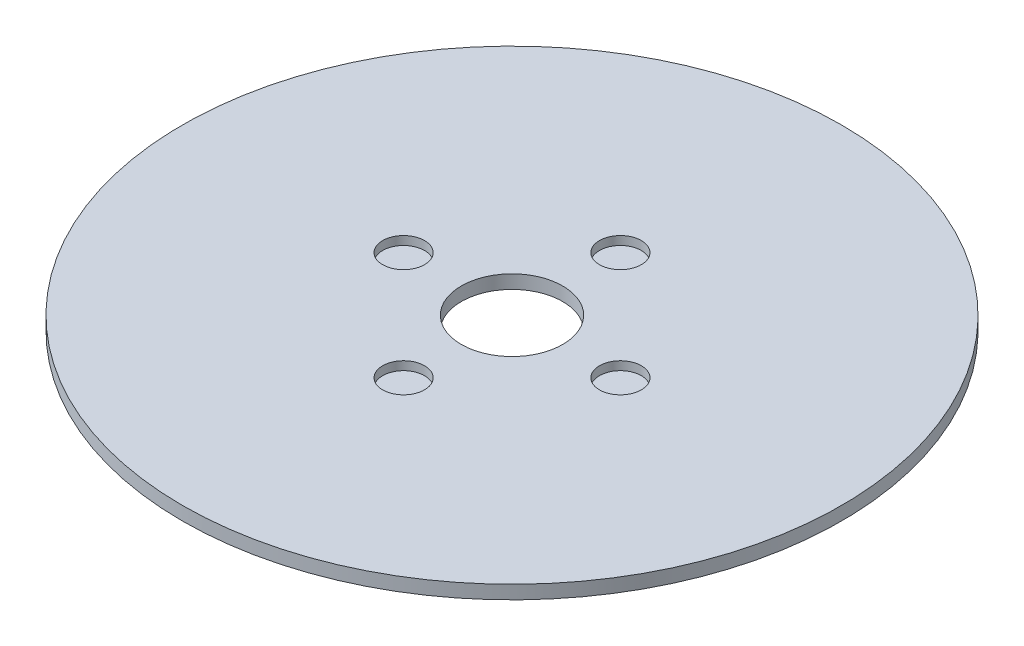
ISO-10303-21;
HEADER;
FILE_DESCRIPTION(('STEP AP214'),'2;1');
FILE_NAME('part.step','',(''),(''),'','','');
FILE_SCHEMA(('AUTOMOTIVE_DESIGN { 1 0 10303 214 1 1 1 1 }'));
ENDSEC;
DATA;
#1=APPLICATION_CONTEXT('core data for automotive mechanical design processes');
#2=APPLICATION_PROTOCOL_DEFINITION('international standard','automotive_design',2000,#1);
#3=PRODUCT_CONTEXT('',#1,'mechanical');
#4=PRODUCT('Part','Part','',(#3));
#5=PRODUCT_RELATED_PRODUCT_CATEGORY('part','',(#4));
#6=PRODUCT_DEFINITION_FORMATION('','',#4);
#7=PRODUCT_DEFINITION_CONTEXT('part definition',#1,'design');
#8=PRODUCT_DEFINITION('design','',#6,#7);
#9=PRODUCT_DEFINITION_SHAPE('','',#8);
#10=(LENGTH_UNIT() NAMED_UNIT(*) SI_UNIT(.MILLI.,.METRE.));
#11=(NAMED_UNIT(*) PLANE_ANGLE_UNIT() SI_UNIT($,.RADIAN.));
#12=(NAMED_UNIT(*) SI_UNIT($,.STERADIAN.) SOLID_ANGLE_UNIT());
#13=UNCERTAINTY_MEASURE_WITH_UNIT(LENGTH_MEASURE(1.E-05),#10,'distance_accuracy_value','');
#14=(GEOMETRIC_REPRESENTATION_CONTEXT(3) GLOBAL_UNCERTAINTY_ASSIGNED_CONTEXT((#13)) GLOBAL_UNIT_ASSIGNED_CONTEXT((#10,
#11,#12)) REPRESENTATION_CONTEXT('',''));
#15=CARTESIAN_POINT('',(0.,0.,0.));
#16=DIRECTION('',(0.,0.,1.));
#17=DIRECTION('',(1.,0.,0.));
#18=AXIS2_PLACEMENT_3D('',#15,#16,#17);
#19=CARTESIAN_POINT('',(0.,4.,0.));
#20=DIRECTION('',(0.,-1.,0.));
#21=DIRECTION('',(0.,0.,-1.));
#22=AXIS2_PLACEMENT_3D('',#19,#20,#21);
#23=CYLINDRICAL_SURFACE('',#22,97.5);
#24=CARTESIAN_POINT('',(0.,4.,0.));
#25=DIRECTION('',(0.,1.,0.));
#26=DIRECTION('',(0.,0.,1.));
#27=AXIS2_PLACEMENT_3D('',#24,#25,#26);
#28=CIRCLE('',#27,97.5);
#29=CARTESIAN_POINT('',(0.,4.,97.5));
#30=VERTEX_POINT('',#29);
#31=EDGE_CURVE('E10',#30,#30,#28,.T.);
#32=ORIENTED_EDGE('',*,*,#31,.F.);
#33=EDGE_LOOP('',(#32));
#34=FACE_BOUND('',#33,.T.);
#35=CARTESIAN_POINT('',(0.,0.,0.));
#36=DIRECTION('',(0.,1.,0.));
#37=DIRECTION('',(0.,0.,1.));
#38=AXIS2_PLACEMENT_3D('',#35,#36,#37);
#39=CIRCLE('',#38,97.5);
#40=CARTESIAN_POINT('',(0.,0.,97.5));
#41=VERTEX_POINT('',#40);
#42=EDGE_CURVE('E37',#41,#41,#39,.T.);
#43=ORIENTED_EDGE('',*,*,#42,.T.);
#44=EDGE_LOOP('',(#43));
#45=FACE_BOUND('',#44,.T.);
#46=ADVANCED_FACE('F40',(#34,#45),#23,.T.);
#47=CARTESIAN_POINT('',(0.,4.,0.));
#48=DIRECTION('',(0.,1.,0.));
#49=DIRECTION('',(0.,0.,1.));
#50=AXIS2_PLACEMENT_3D('',#47,#48,#49);
#51=PLANE('',#50);
#52=CARTESIAN_POINT('',(1.11978454207398E-13,4.,32.0719039685606));
#53=DIRECTION('',(0.,1.,0.));
#54=DIRECTION('',(1.,0.,0.));
#55=AXIS2_PLACEMENT_3D('',#52,#53,#54);
#56=CIRCLE('',#55,6.19048479109425);
#57=CARTESIAN_POINT('',(1.11978454207398E-13,4.,38.2623887596549));
#58=VERTEX_POINT('',#57);
#59=EDGE_CURVE('E71',#58,#58,#56,.T.);
#60=ORIENTED_EDGE('',*,*,#59,.F.);
#61=EDGE_LOOP('',(#60));
#62=FACE_BOUND('',#61,.T.);
#63=CARTESIAN_POINT('',(32.0719039685606,4.,0.));
#64=DIRECTION('',(0.,1.,0.));
#65=DIRECTION('',(0.,0.,-1.));
#66=AXIS2_PLACEMENT_3D('',#63,#64,#65);
#67=CIRCLE('',#66,6.19048479109425);
#68=CARTESIAN_POINT('',(32.0719039685606,4.,6.19048479109425));
#69=VERTEX_POINT('',#68);
#70=EDGE_CURVE('E70',#69,#69,#67,.T.);
#71=ORIENTED_EDGE('',*,*,#70,.F.);
#72=EDGE_LOOP('',(#71));
#73=FACE_BOUND('',#72,.T.);
#74=CARTESIAN_POINT('',(-3.35935362622195E-13,4.,-32.0719039685606));
#75=DIRECTION('',(0.,1.,0.));
#76=DIRECTION('',(-1.,0.,0.));
#77=AXIS2_PLACEMENT_3D('',#74,#75,#76);
#78=CIRCLE('',#77,6.19048479109425);
#79=CARTESIAN_POINT('',(-3.35935362622195E-13,4.,-25.8814191774664));
#80=VERTEX_POINT('',#79);
#81=EDGE_CURVE('E61',#80,#80,#78,.T.);
#82=ORIENTED_EDGE('',*,*,#81,.F.);
#83=EDGE_LOOP('',(#82));
#84=FACE_BOUND('',#83,.T.);
#85=CARTESIAN_POINT('',(-32.0719039685606,4.,0.));
#86=DIRECTION('',(0.,1.,0.));
#87=DIRECTION('',(0.,0.,1.));
#88=AXIS2_PLACEMENT_3D('',#85,#86,#87);
#89=CIRCLE('',#88,6.19048479109425);
#90=CARTESIAN_POINT('',(-32.0719039685606,4.,6.19048479109425));
#91=VERTEX_POINT('',#90);
#92=EDGE_CURVE('E54',#91,#91,#89,.T.);
#93=ORIENTED_EDGE('',*,*,#92,.F.);
#94=EDGE_LOOP('',(#93));
#95=FACE_BOUND('',#94,.T.);
#96=CARTESIAN_POINT('',(0.,4.,0.));
#97=DIRECTION('',(0.,1.,0.));
#98=DIRECTION('',(0.,0.,1.));
#99=AXIS2_PLACEMENT_3D('',#96,#97,#98);
#100=CIRCLE('',#99,15.);
#101=CARTESIAN_POINT('',(0.,4.,15.));
#102=VERTEX_POINT('',#101);
#103=EDGE_CURVE('E50',#102,#102,#100,.T.);
#104=ORIENTED_EDGE('',*,*,#103,.F.);
#105=EDGE_LOOP('',(#104));
#106=FACE_BOUND('',#105,.T.);
#107=ORIENTED_EDGE('',*,*,#31,.T.);
#108=EDGE_LOOP('',(#107));
#109=FACE_BOUND('',#108,.T.);
#110=ADVANCED_FACE('F86',(#62,#73,#84,#95,#106,#109),#51,.T.);
#111=CARTESIAN_POINT('',(0.,0.,0.));
#112=DIRECTION('',(0.,1.,0.));
#113=DIRECTION('',(0.,0.,1.));
#114=AXIS2_PLACEMENT_3D('',#111,#112,#113);
#115=PLANE('',#114);
#116=CARTESIAN_POINT('',(0.,0.,0.));
#117=DIRECTION('',(0.,1.,0.));
#118=DIRECTION('',(0.,0.,1.));
#119=AXIS2_PLACEMENT_3D('',#116,#117,#118);
#120=CIRCLE('',#119,15.);
#121=CARTESIAN_POINT('',(0.,0.,15.));
#122=VERTEX_POINT('',#121);
#123=EDGE_CURVE('E47',#122,#122,#120,.T.);
#124=ORIENTED_EDGE('',*,*,#123,.T.);
#125=EDGE_LOOP('',(#124));
#126=FACE_BOUND('',#125,.T.);
#127=ORIENTED_EDGE('',*,*,#42,.F.);
#128=EDGE_LOOP('',(#127));
#129=FACE_BOUND('',#128,.T.);
#130=ADVANCED_FACE('F93',(#126,#129),#115,.F.);
#131=CARTESIAN_POINT('',(0.,4.,0.));
#132=DIRECTION('',(0.,-1.,0.));
#133=DIRECTION('',(0.,0.,-1.));
#134=AXIS2_PLACEMENT_3D('',#131,#132,#133);
#135=CYLINDRICAL_SURFACE('',#134,15.);
#136=ORIENTED_EDGE('',*,*,#103,.T.);
#137=EDGE_LOOP('',(#136));
#138=FACE_BOUND('',#137,.T.);
#139=ORIENTED_EDGE('',*,*,#123,.F.);
#140=EDGE_LOOP('',(#139));
#141=FACE_BOUND('',#140,.T.);
#142=ADVANCED_FACE('F101',(#138,#141),#135,.F.);
#143=CARTESIAN_POINT('',(-32.0719039685606,1.44690797379639,0.));
#144=DIRECTION('',(0.,1.,0.));
#145=DIRECTION('',(0.,0.,1.));
#146=AXIS2_PLACEMENT_3D('',#143,#144,#145);
#147=CYLINDRICAL_SURFACE('',#146,6.19048479109425);
#148=CARTESIAN_POINT('',(-32.0719039685606,1.44690797379639,0.));
#149=DIRECTION('',(0.,1.,0.));
#150=DIRECTION('',(0.,0.,1.));
#151=AXIS2_PLACEMENT_3D('',#148,#149,#150);
#152=CIRCLE('',#151,6.19048479109425);
#153=CARTESIAN_POINT('',(-32.0719039685606,1.44690797379639,6.19048479109425));
#154=VERTEX_POINT('',#153);
#155=EDGE_CURVE('E55',#154,#154,#152,.T.);
#156=CARTESIAN_POINT('',(-32.0719039685606,1.44690797379639,6.19048479109425));
#157=CARTESIAN_POINT('',(-32.0719039685606,1.47350268240267,6.19048479109425));
#158=CARTESIAN_POINT('',(-32.0719039685606,1.50009739100896,6.19048479109425));
#159=CARTESIAN_POINT('',(-32.0719039685606,1.55328680822154,6.19048479109425));
#160=CARTESIAN_POINT('',(-32.0719039685606,1.57988151682783,6.19048479109425));
#161=CARTESIAN_POINT('',(-32.0719039685606,1.6330709340404,6.19048479109425));
#162=CARTESIAN_POINT('',(-32.0719039685606,1.65966564264669,6.19048479109425));
#163=CARTESIAN_POINT('',(-32.0719039685606,1.71285505985926,6.19048479109425));
#164=CARTESIAN_POINT('',(-32.0719039685606,1.73944976846555,6.19048479109425));
#165=CARTESIAN_POINT('',(-32.0719039685606,1.79263918567813,6.19048479109425));
#166=CARTESIAN_POINT('',(-32.0719039685606,1.81923389428441,6.19048479109425));
#167=CARTESIAN_POINT('',(-32.0719039685606,1.87242331149699,6.19048479109425));
#168=CARTESIAN_POINT('',(-32.0719039685606,1.89901802010328,6.19048479109425));
#169=CARTESIAN_POINT('',(-32.0719039685606,1.95220743731585,6.19048479109425));
#170=CARTESIAN_POINT('',(-32.0719039685606,1.97880214592214,6.19048479109425));
#171=CARTESIAN_POINT('',(-32.0719039685606,2.03199156313471,6.19048479109425));
#172=CARTESIAN_POINT('',(-32.0719039685606,2.058586271741,6.19048479109425));
#173=CARTESIAN_POINT('',(-32.0719039685606,2.11177568895358,6.19048479109425));
#174=CARTESIAN_POINT('',(-32.0719039685606,2.13837039755987,6.19048479109425));
#175=CARTESIAN_POINT('',(-32.0719039685606,2.19155981477244,6.19048479109425));
#176=CARTESIAN_POINT('',(-32.0719039685606,2.21815452337873,6.19048479109425));
#177=CARTESIAN_POINT('',(-32.0719039685606,2.2713439405913,6.19048479109425));
#178=CARTESIAN_POINT('',(-32.0719039685606,2.29793864919759,6.19048479109425));
#179=CARTESIAN_POINT('',(-32.0719039685606,2.35112806641017,6.19048479109425));
#180=CARTESIAN_POINT('',(-32.0719039685606,2.37772277501645,6.19048479109425));
#181=CARTESIAN_POINT('',(-32.0719039685606,2.43091219222903,6.19048479109425));
#182=CARTESIAN_POINT('',(-32.0719039685606,2.45750690083532,6.19048479109425));
#183=CARTESIAN_POINT('',(-32.0719039685606,2.51069631804789,6.19048479109425));
#184=CARTESIAN_POINT('',(-32.0719039685606,2.53729102665418,6.19048479109425));
#185=CARTESIAN_POINT('',(-32.0719039685606,2.59048044386676,6.19048479109425));
#186=CARTESIAN_POINT('',(-32.0719039685606,2.61707515247304,6.19048479109425));
#187=CARTESIAN_POINT('',(-32.0719039685606,2.67026456968562,6.19048479109425));
#188=CARTESIAN_POINT('',(-32.0719039685606,2.69685927829191,6.19048479109425));
#189=CARTESIAN_POINT('',(-32.0719039685606,2.75004869550448,6.19048479109425));
#190=CARTESIAN_POINT('',(-32.0719039685606,2.77664340411077,6.19048479109425));
#191=CARTESIAN_POINT('',(-32.0719039685606,2.82983282132334,6.19048479109425));
#192=CARTESIAN_POINT('',(-32.0719039685606,2.85642752992963,6.19048479109425));
#193=CARTESIAN_POINT('',(-32.0719039685606,2.90961694714221,6.19048479109425));
#194=CARTESIAN_POINT('',(-32.0719039685606,2.93621165574849,6.19048479109425));
#195=CARTESIAN_POINT('',(-32.0719039685606,2.98940107296107,6.19048479109425));
#196=CARTESIAN_POINT('',(-32.0719039685606,3.01599578156736,6.19048479109425));
#197=CARTESIAN_POINT('',(-32.0719039685606,3.06918519877993,6.19048479109425));
#198=CARTESIAN_POINT('',(-32.0719039685606,3.09577990738622,6.19048479109425));
#199=CARTESIAN_POINT('',(-32.0719039685606,3.1489693245988,6.19048479109425));
#200=CARTESIAN_POINT('',(-32.0719039685606,3.17556403320508,6.19048479109425));
#201=CARTESIAN_POINT('',(-32.0719039685606,3.22875345041766,6.19048479109425));
#202=CARTESIAN_POINT('',(-32.0719039685606,3.25534815902395,6.19048479109425));
#203=CARTESIAN_POINT('',(-32.0719039685606,3.30853757623652,6.19048479109425));
#204=CARTESIAN_POINT('',(-32.0719039685606,3.33513228484281,6.19048479109425));
#205=CARTESIAN_POINT('',(-32.0719039685606,3.38832170205538,6.19048479109425));
#206=CARTESIAN_POINT('',(-32.0719039685606,3.41491641066167,6.19048479109425));
#207=CARTESIAN_POINT('',(-32.0719039685606,3.46810582787425,6.19048479109425));
#208=CARTESIAN_POINT('',(-32.0719039685606,3.49470053648053,6.19048479109425));
#209=CARTESIAN_POINT('',(-32.0719039685606,3.54788995369311,6.19048479109425));
#210=CARTESIAN_POINT('',(-32.0719039685606,3.5744846622994,6.19048479109425));
#211=CARTESIAN_POINT('',(-32.0719039685606,3.62767407951197,6.19048479109425));
#212=CARTESIAN_POINT('',(-32.0719039685606,3.65426878811826,6.19048479109425));
#213=CARTESIAN_POINT('',(-32.0719039685606,3.70745820533084,6.19048479109425));
#214=CARTESIAN_POINT('',(-32.0719039685606,3.73405291393712,6.19048479109425));
#215=CARTESIAN_POINT('',(-32.0719039685606,3.7872423311497,6.19048479109425));
#216=CARTESIAN_POINT('',(-32.0719039685606,3.81383703975599,6.19048479109425));
#217=CARTESIAN_POINT('',(-32.0719039685606,3.86702645696856,6.19048479109425));
#218=CARTESIAN_POINT('',(-32.0719039685606,3.89362116557485,6.19048479109425));
#219=CARTESIAN_POINT('',(-32.0719039685606,3.94681058278742,6.19048479109425));
#220=CARTESIAN_POINT('',(-32.0719039685606,3.97340529139371,6.19048479109425));
#221=CARTESIAN_POINT('',(-32.0719039685606,4.,6.19048479109425));
#222=B_SPLINE_CURVE_WITH_KNOTS('',3,(#156,#157,#158,#159,#160,#161,#162,#163,#164,#165,#166,
#167,#168,#169,#170,#171,#172,#173,#174,#175,#176,#177,#178,#179,#180,#181,#182,#183,#184,#185,
#186,#187,#188,#189,#190,#191,#192,#193,#194,#195,#196,#197,#198,#199,#200,#201,#202,#203,#204,
#205,#206,#207,#208,#209,#210,#211,#212,#213,#214,#215,#216,#217,#218,#219,#220,#221),
.UNSPECIFIED.,.F.,.F.,(4,2,2,2,2,2,2,2,2,2,2,2,2,2,2,2,2,2,2,2,2,2,2,2,2,2,2,2,2,2,2,2,4),(0.,
0.079784125818863,0.159568251637726,0.239352377456589,0.319136503275452,0.398920629094314,
0.478704754913177,0.55848888073204,0.638273006550903,0.718057132369766,0.797841258188629,
0.877625384007492,0.957409509826355,1.03719363564522,1.11697776146408,1.19676188728294,
1.27654601310181,1.35633013892067,1.43611426473953,1.51589839055839,1.59568251637726,
1.67546664219612,1.75525076801498,1.83503489383385,1.91481901965271,1.99460314547157,
2.07438727129043,2.1541713971093,2.23395552292816,2.31373964874702,2.39352377456589,
2.47330790038475,2.55309202620361),.UNSPECIFIED.);
#223=EDGE_CURVE('BSEAM102',#154,#91,#222,.T.);
#224=ORIENTED_EDGE('',*,*,#155,.F.);
#225=ORIENTED_EDGE('',*,*,#92,.T.);
#226=ORIENTED_EDGE('',*,*,#223,.T.);
#227=ORIENTED_EDGE('',*,*,#223,.F.);
#228=EDGE_LOOP('',(#224,#226,#225,#227));
#229=FACE_BOUND('',#228,.T.);
#230=ADVANCED_FACE('F102',(#229),#147,.F.);
#231=CARTESIAN_POINT('',(-32.0719039685606,1.44690797379639,0.));
#232=DIRECTION('',(0.,1.,0.));
#233=DIRECTION('',(0.,0.,1.));
#234=AXIS2_PLACEMENT_3D('',#231,#232,#233);
#235=PLANE('',#234);
#236=ORIENTED_EDGE('',*,*,#155,.T.);
#237=EDGE_LOOP('',(#236));
#238=FACE_BOUND('',#237,.T.);
#239=ADVANCED_FACE('F133',(#238),#235,.T.);
#240=CARTESIAN_POINT('',(-3.35935362622195E-13,1.44690797379639,-32.0719039685606));
#241=DIRECTION('',(0.,1.,0.));
#242=DIRECTION('',(0.,0.,1.));
#243=AXIS2_PLACEMENT_3D('',#240,#241,#242);
#244=CYLINDRICAL_SURFACE('',#243,6.19048479109425);
#245=CARTESIAN_POINT('',(-3.35935362622195E-13,1.44690797379639,-32.0719039685606));
#246=DIRECTION('',(0.,1.,0.));
#247=DIRECTION('',(-1.,0.,0.));
#248=AXIS2_PLACEMENT_3D('',#245,#246,#247);
#249=CIRCLE('',#248,6.19048479109425);
#250=CARTESIAN_POINT('',(-3.35935362622195E-13,1.44690797379639,-25.8814191774664));
#251=VERTEX_POINT('',#250);
#252=EDGE_CURVE('E63',#251,#251,#249,.T.);
#253=CARTESIAN_POINT('',(-3.35935362622195E-13,1.44690797379639,-25.8814191774664));
#254=CARTESIAN_POINT('',(-3.35935362622195E-13,1.47350268240267,-25.8814191774664));
#255=CARTESIAN_POINT('',(-3.35935362622195E-13,1.50009739100896,-25.8814191774664));
#256=CARTESIAN_POINT('',(-3.35935362622195E-13,1.55328680822154,-25.8814191774664));
#257=CARTESIAN_POINT('',(-3.35935362622195E-13,1.57988151682783,-25.8814191774664));
#258=CARTESIAN_POINT('',(-3.35935362622195E-13,1.6330709340404,-25.8814191774664));
#259=CARTESIAN_POINT('',(-3.35935362622195E-13,1.65966564264669,-25.8814191774664));
#260=CARTESIAN_POINT('',(-3.35935362622195E-13,1.71285505985926,-25.8814191774664));
#261=CARTESIAN_POINT('',(-3.35935362622195E-13,1.73944976846555,-25.8814191774664));
#262=CARTESIAN_POINT('',(-3.35935362622195E-13,1.79263918567813,-25.8814191774664));
#263=CARTESIAN_POINT('',(-3.35935362622195E-13,1.81923389428441,-25.8814191774664));
#264=CARTESIAN_POINT('',(-3.35935362622195E-13,1.87242331149699,-25.8814191774664));
#265=CARTESIAN_POINT('',(-3.35935362622195E-13,1.89901802010328,-25.8814191774664));
#266=CARTESIAN_POINT('',(-3.35935362622195E-13,1.95220743731585,-25.8814191774664));
#267=CARTESIAN_POINT('',(-3.35935362622195E-13,1.97880214592214,-25.8814191774664));
#268=CARTESIAN_POINT('',(-3.35935362622195E-13,2.03199156313471,-25.8814191774664));
#269=CARTESIAN_POINT('',(-3.35935362622195E-13,2.058586271741,-25.8814191774664));
#270=CARTESIAN_POINT('',(-3.35935362622195E-13,2.11177568895358,-25.8814191774664));
#271=CARTESIAN_POINT('',(-3.35935362622195E-13,2.13837039755987,-25.8814191774664));
#272=CARTESIAN_POINT('',(-3.35935362622195E-13,2.19155981477244,-25.8814191774664));
#273=CARTESIAN_POINT('',(-3.35935362622195E-13,2.21815452337873,-25.8814191774664));
#274=CARTESIAN_POINT('',(-3.35935362622195E-13,2.2713439405913,-25.8814191774664));
#275=CARTESIAN_POINT('',(-3.35935362622195E-13,2.29793864919759,-25.8814191774664));
#276=CARTESIAN_POINT('',(-3.35935362622195E-13,2.35112806641017,-25.8814191774664));
#277=CARTESIAN_POINT('',(-3.35935362622195E-13,2.37772277501645,-25.8814191774664));
#278=CARTESIAN_POINT('',(-3.35935362622195E-13,2.43091219222903,-25.8814191774664));
#279=CARTESIAN_POINT('',(-3.35935362622195E-13,2.45750690083532,-25.8814191774664));
#280=CARTESIAN_POINT('',(-3.35935362622195E-13,2.51069631804789,-25.8814191774664));
#281=CARTESIAN_POINT('',(-3.35935362622195E-13,2.53729102665418,-25.8814191774664));
#282=CARTESIAN_POINT('',(-3.35935362622195E-13,2.59048044386676,-25.8814191774664));
#283=CARTESIAN_POINT('',(-3.35935362622195E-13,2.61707515247304,-25.8814191774664));
#284=CARTESIAN_POINT('',(-3.35935362622195E-13,2.67026456968562,-25.8814191774664));
#285=CARTESIAN_POINT('',(-3.35935362622195E-13,2.69685927829191,-25.8814191774664));
#286=CARTESIAN_POINT('',(-3.35935362622195E-13,2.75004869550448,-25.8814191774664));
#287=CARTESIAN_POINT('',(-3.35935362622195E-13,2.77664340411077,-25.8814191774664));
#288=CARTESIAN_POINT('',(-3.35935362622195E-13,2.82983282132334,-25.8814191774664));
#289=CARTESIAN_POINT('',(-3.35935362622195E-13,2.85642752992963,-25.8814191774664));
#290=CARTESIAN_POINT('',(-3.35935362622195E-13,2.90961694714221,-25.8814191774664));
#291=CARTESIAN_POINT('',(-3.35935362622195E-13,2.93621165574849,-25.8814191774664));
#292=CARTESIAN_POINT('',(-3.35935362622195E-13,2.98940107296107,-25.8814191774664));
#293=CARTESIAN_POINT('',(-3.35935362622195E-13,3.01599578156736,-25.8814191774664));
#294=CARTESIAN_POINT('',(-3.35935362622195E-13,3.06918519877993,-25.8814191774664));
#295=CARTESIAN_POINT('',(-3.35935362622195E-13,3.09577990738622,-25.8814191774664));
#296=CARTESIAN_POINT('',(-3.35935362622195E-13,3.1489693245988,-25.8814191774664));
#297=CARTESIAN_POINT('',(-3.35935362622195E-13,3.17556403320508,-25.8814191774664));
#298=CARTESIAN_POINT('',(-3.35935362622195E-13,3.22875345041766,-25.8814191774664));
#299=CARTESIAN_POINT('',(-3.35935362622195E-13,3.25534815902395,-25.8814191774664));
#300=CARTESIAN_POINT('',(-3.35935362622195E-13,3.30853757623652,-25.8814191774664));
#301=CARTESIAN_POINT('',(-3.35935362622195E-13,3.33513228484281,-25.8814191774664));
#302=CARTESIAN_POINT('',(-3.35935362622195E-13,3.38832170205538,-25.8814191774664));
#303=CARTESIAN_POINT('',(-3.35935362622195E-13,3.41491641066167,-25.8814191774664));
#304=CARTESIAN_POINT('',(-3.35935362622195E-13,3.46810582787425,-25.8814191774664));
#305=CARTESIAN_POINT('',(-3.35935362622195E-13,3.49470053648053,-25.8814191774664));
#306=CARTESIAN_POINT('',(-3.35935362622195E-13,3.54788995369311,-25.8814191774664));
#307=CARTESIAN_POINT('',(-3.35935362622195E-13,3.5744846622994,-25.8814191774664));
#308=CARTESIAN_POINT('',(-3.35935362622195E-13,3.62767407951197,-25.8814191774664));
#309=CARTESIAN_POINT('',(-3.35935362622195E-13,3.65426878811826,-25.8814191774664));
#310=CARTESIAN_POINT('',(-3.35935362622195E-13,3.70745820533084,-25.8814191774664));
#311=CARTESIAN_POINT('',(-3.35935362622195E-13,3.73405291393712,-25.8814191774664));
#312=CARTESIAN_POINT('',(-3.35935362622195E-13,3.7872423311497,-25.8814191774664));
#313=CARTESIAN_POINT('',(-3.35935362622195E-13,3.81383703975599,-25.8814191774664));
#314=CARTESIAN_POINT('',(-3.35935362622195E-13,3.86702645696856,-25.8814191774664));
#315=CARTESIAN_POINT('',(-3.35935362622195E-13,3.89362116557485,-25.8814191774664));
#316=CARTESIAN_POINT('',(-3.35935362622195E-13,3.94681058278742,-25.8814191774664));
#317=CARTESIAN_POINT('',(-3.35935362622195E-13,3.97340529139371,-25.8814191774664));
#318=CARTESIAN_POINT('',(-3.35935362622195E-13,4.,-25.8814191774664));
#319=B_SPLINE_CURVE_WITH_KNOTS('',3,(#253,#254,#255,#256,#257,#258,#259,#260,#261,#262,#263,
#264,#265,#266,#267,#268,#269,#270,#271,#272,#273,#274,#275,#276,#277,#278,#279,#280,#281,#282,
#283,#284,#285,#286,#287,#288,#289,#290,#291,#292,#293,#294,#295,#296,#297,#298,#299,#300,#301,
#302,#303,#304,#305,#306,#307,#308,#309,#310,#311,#312,#313,#314,#315,#316,#317,#318),
.UNSPECIFIED.,.F.,.F.,(4,2,2,2,2,2,2,2,2,2,2,2,2,2,2,2,2,2,2,2,2,2,2,2,2,2,2,2,2,2,2,2,4),(0.,
0.079784125818863,0.159568251637726,0.239352377456589,0.319136503275452,0.398920629094314,
0.478704754913177,0.55848888073204,0.638273006550903,0.718057132369766,0.797841258188629,
0.877625384007492,0.957409509826355,1.03719363564522,1.11697776146408,1.19676188728294,
1.27654601310181,1.35633013892067,1.43611426473953,1.51589839055839,1.59568251637726,
1.67546664219612,1.75525076801498,1.83503489383385,1.91481901965271,1.99460314547157,
2.07438727129043,2.1541713971093,2.23395552292816,2.31373964874702,2.39352377456589,
2.47330790038475,2.55309202620361),.UNSPECIFIED.);
#320=EDGE_CURVE('BSEAM142',#251,#80,#319,.T.);
#321=ORIENTED_EDGE('',*,*,#252,.F.);
#322=ORIENTED_EDGE('',*,*,#81,.T.);
#323=ORIENTED_EDGE('',*,*,#320,.T.);
#324=ORIENTED_EDGE('',*,*,#320,.F.);
#325=EDGE_LOOP('',(#321,#323,#322,#324));
#326=FACE_BOUND('',#325,.T.);
#327=ADVANCED_FACE('F142',(#326),#244,.F.);
#328=CARTESIAN_POINT('',(-3.35935362622195E-13,1.44690797379639,-32.0719039685606));
#329=DIRECTION('',(0.,1.,0.));
#330=DIRECTION('',(-1.,0.,0.));
#331=AXIS2_PLACEMENT_3D('',#328,#329,#330);
#332=PLANE('',#331);
#333=ORIENTED_EDGE('',*,*,#252,.T.);
#334=EDGE_LOOP('',(#333));
#335=FACE_BOUND('',#334,.T.);
#336=ADVANCED_FACE('F156',(#335),#332,.T.);
#337=CARTESIAN_POINT('',(32.0719039685606,1.44690797379639,0.));
#338=DIRECTION('',(0.,1.,0.));
#339=DIRECTION('',(0.,0.,1.));
#340=AXIS2_PLACEMENT_3D('',#337,#338,#339);
#341=CYLINDRICAL_SURFACE('',#340,6.19048479109425);
#342=CARTESIAN_POINT('',(32.0719039685606,1.44690797379639,0.));
#343=DIRECTION('',(0.,1.,0.));
#344=DIRECTION('',(0.,0.,-1.));
#345=AXIS2_PLACEMENT_3D('',#342,#343,#344);
#346=CIRCLE('',#345,6.19048479109425);
#347=CARTESIAN_POINT('',(32.0719039685606,1.44690797379639,6.19048479109425));
#348=VERTEX_POINT('',#347);
#349=EDGE_CURVE('E69',#348,#348,#346,.T.);
#350=CARTESIAN_POINT('',(32.0719039685606,1.44690797379639,6.19048479109425));
#351=CARTESIAN_POINT('',(32.0719039685606,1.47350268240267,6.19048479109425));
#352=CARTESIAN_POINT('',(32.0719039685606,1.50009739100896,6.19048479109425));
#353=CARTESIAN_POINT('',(32.0719039685606,1.55328680822154,6.19048479109425));
#354=CARTESIAN_POINT('',(32.0719039685606,1.57988151682783,6.19048479109425));
#355=CARTESIAN_POINT('',(32.0719039685606,1.6330709340404,6.19048479109425));
#356=CARTESIAN_POINT('',(32.0719039685606,1.65966564264669,6.19048479109425));
#357=CARTESIAN_POINT('',(32.0719039685606,1.71285505985926,6.19048479109425));
#358=CARTESIAN_POINT('',(32.0719039685606,1.73944976846555,6.19048479109425));
#359=CARTESIAN_POINT('',(32.0719039685606,1.79263918567813,6.19048479109425));
#360=CARTESIAN_POINT('',(32.0719039685606,1.81923389428441,6.19048479109425));
#361=CARTESIAN_POINT('',(32.0719039685606,1.87242331149699,6.19048479109425));
#362=CARTESIAN_POINT('',(32.0719039685606,1.89901802010328,6.19048479109425));
#363=CARTESIAN_POINT('',(32.0719039685606,1.95220743731585,6.19048479109425));
#364=CARTESIAN_POINT('',(32.0719039685606,1.97880214592214,6.19048479109425));
#365=CARTESIAN_POINT('',(32.0719039685606,2.03199156313471,6.19048479109425));
#366=CARTESIAN_POINT('',(32.0719039685606,2.058586271741,6.19048479109425));
#367=CARTESIAN_POINT('',(32.0719039685606,2.11177568895358,6.19048479109425));
#368=CARTESIAN_POINT('',(32.0719039685606,2.13837039755987,6.19048479109425));
#369=CARTESIAN_POINT('',(32.0719039685606,2.19155981477244,6.19048479109425));
#370=CARTESIAN_POINT('',(32.0719039685606,2.21815452337873,6.19048479109425));
#371=CARTESIAN_POINT('',(32.0719039685606,2.2713439405913,6.19048479109425));
#372=CARTESIAN_POINT('',(32.0719039685606,2.29793864919759,6.19048479109425));
#373=CARTESIAN_POINT('',(32.0719039685606,2.35112806641017,6.19048479109425));
#374=CARTESIAN_POINT('',(32.0719039685606,2.37772277501645,6.19048479109425));
#375=CARTESIAN_POINT('',(32.0719039685606,2.43091219222903,6.19048479109425));
#376=CARTESIAN_POINT('',(32.0719039685606,2.45750690083532,6.19048479109425));
#377=CARTESIAN_POINT('',(32.0719039685606,2.51069631804789,6.19048479109425));
#378=CARTESIAN_POINT('',(32.0719039685606,2.53729102665418,6.19048479109425));
#379=CARTESIAN_POINT('',(32.0719039685606,2.59048044386676,6.19048479109425));
#380=CARTESIAN_POINT('',(32.0719039685606,2.61707515247304,6.19048479109425));
#381=CARTESIAN_POINT('',(32.0719039685606,2.67026456968562,6.19048479109425));
#382=CARTESIAN_POINT('',(32.0719039685606,2.69685927829191,6.19048479109425));
#383=CARTESIAN_POINT('',(32.0719039685606,2.75004869550448,6.19048479109425));
#384=CARTESIAN_POINT('',(32.0719039685606,2.77664340411077,6.19048479109425));
#385=CARTESIAN_POINT('',(32.0719039685606,2.82983282132334,6.19048479109425));
#386=CARTESIAN_POINT('',(32.0719039685606,2.85642752992963,6.19048479109425));
#387=CARTESIAN_POINT('',(32.0719039685606,2.90961694714221,6.19048479109425));
#388=CARTESIAN_POINT('',(32.0719039685606,2.93621165574849,6.19048479109425));
#389=CARTESIAN_POINT('',(32.0719039685606,2.98940107296107,6.19048479109425));
#390=CARTESIAN_POINT('',(32.0719039685606,3.01599578156736,6.19048479109425));
#391=CARTESIAN_POINT('',(32.0719039685606,3.06918519877993,6.19048479109425));
#392=CARTESIAN_POINT('',(32.0719039685606,3.09577990738622,6.19048479109425));
#393=CARTESIAN_POINT('',(32.0719039685606,3.1489693245988,6.19048479109425));
#394=CARTESIAN_POINT('',(32.0719039685606,3.17556403320508,6.19048479109425));
#395=CARTESIAN_POINT('',(32.0719039685606,3.22875345041766,6.19048479109425));
#396=CARTESIAN_POINT('',(32.0719039685606,3.25534815902395,6.19048479109425));
#397=CARTESIAN_POINT('',(32.0719039685606,3.30853757623652,6.19048479109425));
#398=CARTESIAN_POINT('',(32.0719039685606,3.33513228484281,6.19048479109425));
#399=CARTESIAN_POINT('',(32.0719039685606,3.38832170205538,6.19048479109425));
#400=CARTESIAN_POINT('',(32.0719039685606,3.41491641066167,6.19048479109425));
#401=CARTESIAN_POINT('',(32.0719039685606,3.46810582787425,6.19048479109425));
#402=CARTESIAN_POINT('',(32.0719039685606,3.49470053648053,6.19048479109425));
#403=CARTESIAN_POINT('',(32.0719039685606,3.54788995369311,6.19048479109425));
#404=CARTESIAN_POINT('',(32.0719039685606,3.5744846622994,6.19048479109425));
#405=CARTESIAN_POINT('',(32.0719039685606,3.62767407951197,6.19048479109425));
#406=CARTESIAN_POINT('',(32.0719039685606,3.65426878811826,6.19048479109425));
#407=CARTESIAN_POINT('',(32.0719039685606,3.70745820533084,6.19048479109425));
#408=CARTESIAN_POINT('',(32.0719039685606,3.73405291393712,6.19048479109425));
#409=CARTESIAN_POINT('',(32.0719039685606,3.7872423311497,6.19048479109425));
#410=CARTESIAN_POINT('',(32.0719039685606,3.81383703975599,6.19048479109425));
#411=CARTESIAN_POINT('',(32.0719039685606,3.86702645696856,6.19048479109425));
#412=CARTESIAN_POINT('',(32.0719039685606,3.89362116557485,6.19048479109425));
#413=CARTESIAN_POINT('',(32.0719039685606,3.94681058278742,6.19048479109425));
#414=CARTESIAN_POINT('',(32.0719039685606,3.97340529139371,6.19048479109425));
#415=CARTESIAN_POINT('',(32.0719039685606,4.,6.19048479109425));
#416=B_SPLINE_CURVE_WITH_KNOTS('',3,(#350,#351,#352,#353,#354,#355,#356,#357,#358,#359,#360,
#361,#362,#363,#364,#365,#366,#367,#368,#369,#370,#371,#372,#373,#374,#375,#376,#377,#378,#379,
#380,#381,#382,#383,#384,#385,#386,#387,#388,#389,#390,#391,#392,#393,#394,#395,#396,#397,#398,
#399,#400,#401,#402,#403,#404,#405,#406,#407,#408,#409,#410,#411,#412,#413,#414,#415),
.UNSPECIFIED.,.F.,.F.,(4,2,2,2,2,2,2,2,2,2,2,2,2,2,2,2,2,2,2,2,2,2,2,2,2,2,2,2,2,2,2,2,4),(0.,
0.079784125818863,0.159568251637726,0.239352377456589,0.319136503275452,0.398920629094314,
0.478704754913177,0.55848888073204,0.638273006550903,0.718057132369766,0.797841258188629,
0.877625384007492,0.957409509826355,1.03719363564522,1.11697776146408,1.19676188728294,
1.27654601310181,1.35633013892067,1.43611426473953,1.51589839055839,1.59568251637726,
1.67546664219612,1.75525076801498,1.83503489383385,1.91481901965271,1.99460314547157,
2.07438727129043,2.1541713971093,2.23395552292816,2.31373964874702,2.39352377456589,
2.47330790038475,2.55309202620361),.UNSPECIFIED.);
#417=EDGE_CURVE('BSEAM164',#348,#69,#416,.T.);
#418=ORIENTED_EDGE('',*,*,#349,.F.);
#419=ORIENTED_EDGE('',*,*,#70,.T.);
#420=ORIENTED_EDGE('',*,*,#417,.T.);
#421=ORIENTED_EDGE('',*,*,#417,.F.);
#422=EDGE_LOOP('',(#418,#420,#419,#421));
#423=FACE_BOUND('',#422,.T.);
#424=ADVANCED_FACE('F164',(#423),#341,.F.);
#425=CARTESIAN_POINT('',(32.0719039685606,1.44690797379639,0.));
#426=DIRECTION('',(0.,1.,0.));
#427=DIRECTION('',(0.,0.,-1.));
#428=AXIS2_PLACEMENT_3D('',#425,#426,#427);
#429=PLANE('',#428);
#430=ORIENTED_EDGE('',*,*,#349,.T.);
#431=EDGE_LOOP('',(#430));
#432=FACE_BOUND('',#431,.T.);
#433=ADVANCED_FACE('F83',(#432),#429,.T.);
#434=CARTESIAN_POINT('',(1.11978454207398E-13,1.44690797379639,32.0719039685606));
#435=DIRECTION('',(0.,1.,0.));
#436=DIRECTION('',(0.,0.,1.));
#437=AXIS2_PLACEMENT_3D('',#434,#435,#436);
#438=CYLINDRICAL_SURFACE('',#437,6.19048479109425);
#439=CARTESIAN_POINT('',(1.11978454207398E-13,1.44690797379639,32.0719039685606));
#440=DIRECTION('',(0.,1.,0.));
#441=DIRECTION('',(1.,0.,0.));
#442=AXIS2_PLACEMENT_3D('',#439,#440,#441);
#443=CIRCLE('',#442,6.19048479109425);
#444=CARTESIAN_POINT('',(1.11978454207398E-13,1.44690797379639,38.2623887596549));
#445=VERTEX_POINT('',#444);
#446=EDGE_CURVE('E59',#445,#445,#443,.T.);
#447=CARTESIAN_POINT('',(1.11978454207398E-13,1.44690797379639,38.2623887596549));
#448=CARTESIAN_POINT('',(1.11978454207398E-13,1.47350268240267,38.2623887596549));
#449=CARTESIAN_POINT('',(1.11978454207398E-13,1.50009739100896,38.2623887596549));
#450=CARTESIAN_POINT('',(1.11978454207398E-13,1.55328680822154,38.2623887596549));
#451=CARTESIAN_POINT('',(1.11978454207398E-13,1.57988151682783,38.2623887596549));
#452=CARTESIAN_POINT('',(1.11978454207398E-13,1.6330709340404,38.2623887596549));
#453=CARTESIAN_POINT('',(1.11978454207398E-13,1.65966564264669,38.2623887596549));
#454=CARTESIAN_POINT('',(1.11978454207398E-13,1.71285505985926,38.2623887596549));
#455=CARTESIAN_POINT('',(1.11978454207398E-13,1.73944976846555,38.2623887596549));
#456=CARTESIAN_POINT('',(1.11978454207398E-13,1.79263918567813,38.2623887596549));
#457=CARTESIAN_POINT('',(1.11978454207398E-13,1.81923389428441,38.2623887596549));
#458=CARTESIAN_POINT('',(1.11978454207398E-13,1.87242331149699,38.2623887596549));
#459=CARTESIAN_POINT('',(1.11978454207398E-13,1.89901802010328,38.2623887596549));
#460=CARTESIAN_POINT('',(1.11978454207398E-13,1.95220743731585,38.2623887596549));
#461=CARTESIAN_POINT('',(1.11978454207398E-13,1.97880214592214,38.2623887596549));
#462=CARTESIAN_POINT('',(1.11978454207398E-13,2.03199156313471,38.2623887596549));
#463=CARTESIAN_POINT('',(1.11978454207398E-13,2.058586271741,38.2623887596549));
#464=CARTESIAN_POINT('',(1.11978454207398E-13,2.11177568895358,38.2623887596549));
#465=CARTESIAN_POINT('',(1.11978454207398E-13,2.13837039755987,38.2623887596549));
#466=CARTESIAN_POINT('',(1.11978454207398E-13,2.19155981477244,38.2623887596549));
#467=CARTESIAN_POINT('',(1.11978454207398E-13,2.21815452337873,38.2623887596549));
#468=CARTESIAN_POINT('',(1.11978454207398E-13,2.2713439405913,38.2623887596549));
#469=CARTESIAN_POINT('',(1.11978454207398E-13,2.29793864919759,38.2623887596549));
#470=CARTESIAN_POINT('',(1.11978454207398E-13,2.35112806641017,38.2623887596549));
#471=CARTESIAN_POINT('',(1.11978454207398E-13,2.37772277501645,38.2623887596549));
#472=CARTESIAN_POINT('',(1.11978454207398E-13,2.43091219222903,38.2623887596549));
#473=CARTESIAN_POINT('',(1.11978454207398E-13,2.45750690083532,38.2623887596549));
#474=CARTESIAN_POINT('',(1.11978454207398E-13,2.51069631804789,38.2623887596549));
#475=CARTESIAN_POINT('',(1.11978454207398E-13,2.53729102665418,38.2623887596549));
#476=CARTESIAN_POINT('',(1.11978454207398E-13,2.59048044386676,38.2623887596549));
#477=CARTESIAN_POINT('',(1.11978454207398E-13,2.61707515247304,38.2623887596549));
#478=CARTESIAN_POINT('',(1.11978454207398E-13,2.67026456968562,38.2623887596549));
#479=CARTESIAN_POINT('',(1.11978454207398E-13,2.69685927829191,38.2623887596549));
#480=CARTESIAN_POINT('',(1.11978454207398E-13,2.75004869550448,38.2623887596549));
#481=CARTESIAN_POINT('',(1.11978454207398E-13,2.77664340411077,38.2623887596549));
#482=CARTESIAN_POINT('',(1.11978454207398E-13,2.82983282132334,38.2623887596549));
#483=CARTESIAN_POINT('',(1.11978454207398E-13,2.85642752992963,38.2623887596549));
#484=CARTESIAN_POINT('',(1.11978454207398E-13,2.90961694714221,38.2623887596549));
#485=CARTESIAN_POINT('',(1.11978454207398E-13,2.93621165574849,38.2623887596549));
#486=CARTESIAN_POINT('',(1.11978454207398E-13,2.98940107296107,38.2623887596549));
#487=CARTESIAN_POINT('',(1.11978454207398E-13,3.01599578156736,38.2623887596549));
#488=CARTESIAN_POINT('',(1.11978454207398E-13,3.06918519877993,38.2623887596549));
#489=CARTESIAN_POINT('',(1.11978454207398E-13,3.09577990738622,38.2623887596549));
#490=CARTESIAN_POINT('',(1.11978454207398E-13,3.1489693245988,38.2623887596549));
#491=CARTESIAN_POINT('',(1.11978454207398E-13,3.17556403320508,38.2623887596549));
#492=CARTESIAN_POINT('',(1.11978454207398E-13,3.22875345041766,38.2623887596549));
#493=CARTESIAN_POINT('',(1.11978454207398E-13,3.25534815902395,38.2623887596549));
#494=CARTESIAN_POINT('',(1.11978454207398E-13,3.30853757623652,38.2623887596549));
#495=CARTESIAN_POINT('',(1.11978454207398E-13,3.33513228484281,38.2623887596549));
#496=CARTESIAN_POINT('',(1.11978454207398E-13,3.38832170205538,38.2623887596549));
#497=CARTESIAN_POINT('',(1.11978454207398E-13,3.41491641066167,38.2623887596549));
#498=CARTESIAN_POINT('',(1.11978454207398E-13,3.46810582787425,38.2623887596549));
#499=CARTESIAN_POINT('',(1.11978454207398E-13,3.49470053648053,38.2623887596549));
#500=CARTESIAN_POINT('',(1.11978454207398E-13,3.54788995369311,38.2623887596549));
#501=CARTESIAN_POINT('',(1.11978454207398E-13,3.5744846622994,38.2623887596549));
#502=CARTESIAN_POINT('',(1.11978454207398E-13,3.62767407951197,38.2623887596549));
#503=CARTESIAN_POINT('',(1.11978454207398E-13,3.65426878811826,38.2623887596549));
#504=CARTESIAN_POINT('',(1.11978454207398E-13,3.70745820533084,38.2623887596549));
#505=CARTESIAN_POINT('',(1.11978454207398E-13,3.73405291393712,38.2623887596549));
#506=CARTESIAN_POINT('',(1.11978454207398E-13,3.7872423311497,38.2623887596549));
#507=CARTESIAN_POINT('',(1.11978454207398E-13,3.81383703975599,38.2623887596549));
#508=CARTESIAN_POINT('',(1.11978454207398E-13,3.86702645696856,38.2623887596549));
#509=CARTESIAN_POINT('',(1.11978454207398E-13,3.89362116557485,38.2623887596549));
#510=CARTESIAN_POINT('',(1.11978454207398E-13,3.94681058278742,38.2623887596549));
#511=CARTESIAN_POINT('',(1.11978454207398E-13,3.97340529139371,38.2623887596549));
#512=CARTESIAN_POINT('',(1.11978454207398E-13,4.,38.2623887596549));
#513=B_SPLINE_CURVE_WITH_KNOTS('',3,(#447,#448,#449,#450,#451,#452,#453,#454,#455,#456,#457,
#458,#459,#460,#461,#462,#463,#464,#465,#466,#467,#468,#469,#470,#471,#472,#473,#474,#475,#476,
#477,#478,#479,#480,#481,#482,#483,#484,#485,#486,#487,#488,#489,#490,#491,#492,#493,#494,#495,
#496,#497,#498,#499,#500,#501,#502,#503,#504,#505,#506,#507,#508,#509,#510,#511,#512),
.UNSPECIFIED.,.F.,.F.,(4,2,2,2,2,2,2,2,2,2,2,2,2,2,2,2,2,2,2,2,2,2,2,2,2,2,2,2,2,2,2,2,4),(0.,
0.079784125818863,0.159568251637726,0.239352377456589,0.319136503275452,0.398920629094314,
0.478704754913177,0.55848888073204,0.638273006550903,0.718057132369766,0.797841258188629,
0.877625384007492,0.957409509826355,1.03719363564522,1.11697776146408,1.19676188728294,
1.27654601310181,1.35633013892067,1.43611426473953,1.51589839055839,1.59568251637726,
1.67546664219612,1.75525076801498,1.83503489383385,1.91481901965271,1.99460314547157,
2.07438727129043,2.1541713971093,2.23395552292816,2.31373964874702,2.39352377456589,
2.47330790038475,2.55309202620361),.UNSPECIFIED.);
#514=EDGE_CURVE('BSEAM81',#445,#58,#513,.T.);
#515=ORIENTED_EDGE('',*,*,#446,.F.);
#516=ORIENTED_EDGE('',*,*,#59,.T.);
#517=ORIENTED_EDGE('',*,*,#514,.T.);
#518=ORIENTED_EDGE('',*,*,#514,.F.);
#519=EDGE_LOOP('',(#515,#517,#516,#518));
#520=FACE_BOUND('',#519,.T.);
#521=ADVANCED_FACE('F81',(#520),#438,.F.);
#522=CARTESIAN_POINT('',(1.11978454207398E-13,1.44690797379639,32.0719039685606));
#523=DIRECTION('',(0.,1.,0.));
#524=DIRECTION('',(1.,0.,0.));
#525=AXIS2_PLACEMENT_3D('',#522,#523,#524);
#526=PLANE('',#525);
#527=ORIENTED_EDGE('',*,*,#446,.T.);
#528=EDGE_LOOP('',(#527));
#529=FACE_BOUND('',#528,.T.);
#530=ADVANCED_FACE('F78',(#529),#526,.T.);
#531=CLOSED_SHELL('',(#46,#110,#130,#142,#230,#239,#327,#336,#424,#433,#521,#530));
#532=MANIFOLD_SOLID_BREP('B2',#531);
#533=ADVANCED_BREP_SHAPE_REPRESENTATION('',(#18,#532),#14);
#534=SHAPE_DEFINITION_REPRESENTATION(#9,#533);
ENDSEC;
END-ISO-10303-21;
